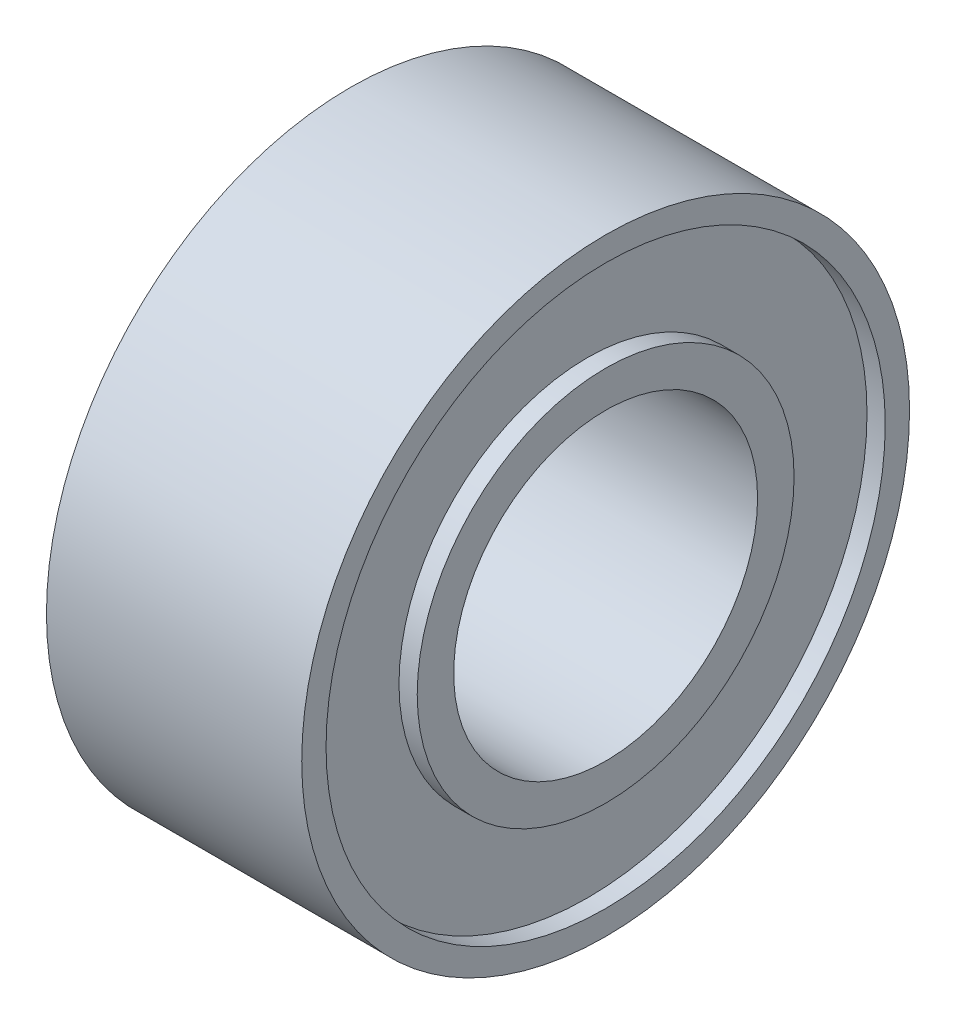
ISO-10303-21;
HEADER;
FILE_DESCRIPTION(('STEP AP214'),'2;1');
FILE_NAME('part.step','',(''),(''),'','','');
FILE_SCHEMA(('AUTOMOTIVE_DESIGN { 1 0 10303 214 1 1 1 1 }'));
ENDSEC;
DATA;
#1=APPLICATION_CONTEXT('core data for automotive mechanical design processes');
#2=APPLICATION_PROTOCOL_DEFINITION('international standard','automotive_design',2000,#1);
#3=PRODUCT_CONTEXT('',#1,'mechanical');
#4=PRODUCT('Part','Part','',(#3));
#5=PRODUCT_RELATED_PRODUCT_CATEGORY('part','',(#4));
#6=PRODUCT_DEFINITION_FORMATION('','',#4);
#7=PRODUCT_DEFINITION_CONTEXT('part definition',#1,'design');
#8=PRODUCT_DEFINITION('design','',#6,#7);
#9=PRODUCT_DEFINITION_SHAPE('','',#8);
#10=(LENGTH_UNIT() NAMED_UNIT(*) SI_UNIT(.MILLI.,.METRE.));
#11=(NAMED_UNIT(*) PLANE_ANGLE_UNIT() SI_UNIT($,.RADIAN.));
#12=(NAMED_UNIT(*) SI_UNIT($,.STERADIAN.) SOLID_ANGLE_UNIT());
#13=UNCERTAINTY_MEASURE_WITH_UNIT(LENGTH_MEASURE(1.E-05),#10,'distance_accuracy_value','');
#14=(GEOMETRIC_REPRESENTATION_CONTEXT(3) GLOBAL_UNCERTAINTY_ASSIGNED_CONTEXT((#13)) GLOBAL_UNIT_ASSIGNED_CONTEXT((#10,
#11,#12)) REPRESENTATION_CONTEXT('',''));
#15=CARTESIAN_POINT('',(0.,0.,0.));
#16=DIRECTION('',(0.,0.,1.));
#17=DIRECTION('',(1.,0.,0.));
#18=AXIS2_PLACEMENT_3D('',#15,#16,#17);
#19=CARTESIAN_POINT('',(-2.09999999999999,2.49999999997641,-2.26485497023532E-11));
#20=DIRECTION('',(-1.,0.,0.));
#21=DIRECTION('',(0.,0.,1.00000000000006));
#22=AXIS2_PLACEMENT_3D('',#19,#20,#21);
#23=PLANE('',#22);
#24=CARTESIAN_POINT('',(-2.09999999999999,0.,0.));
#25=DIRECTION('',(1.,0.,0.));
#26=DIRECTION('',(0.,0.,-1.00000000000006));
#27=AXIS2_PLACEMENT_3D('',#24,#25,#26);
#28=CIRCLE('',#27,2.5);
#29=CARTESIAN_POINT('',(-2.09999999999999,0.,-2.50000000000014));
#30=VERTEX_POINT('',#29);
#31=EDGE_CURVE('E84',#30,#30,#28,.T.);
#32=ORIENTED_EDGE('',*,*,#31,.T.);
#33=EDGE_LOOP('',(#32));
#34=FACE_BOUND('',#33,.T.);
#35=CARTESIAN_POINT('',(-2.09999999999999,0.,0.));
#36=DIRECTION('',(1.,0.,0.));
#37=DIRECTION('',(0.,0.,-1.00000000000006));
#38=AXIS2_PLACEMENT_3D('',#35,#36,#37);
#39=CIRCLE('',#38,3.1);
#40=CARTESIAN_POINT('',(-2.09999999999999,0.,-3.10000000000017));
#41=VERTEX_POINT('',#40);
#42=EDGE_CURVE('E12',#41,#41,#39,.T.);
#43=ORIENTED_EDGE('',*,*,#42,.F.);
#44=EDGE_LOOP('',(#43));
#45=FACE_BOUND('',#44,.T.);
#46=ADVANCED_FACE('F44',(#34,#45),#23,.T.);
#47=CARTESIAN_POINT('',(0.,0.,0.));
#48=DIRECTION('',(1.,0.,0.));
#49=DIRECTION('',(0.,0.,-1.00000000000006));
#50=AXIS2_PLACEMENT_3D('',#47,#48,#49);
#51=CYLINDRICAL_SURFACE('',#50,3.1);
#52=ORIENTED_EDGE('',*,*,#42,.T.);
#53=EDGE_LOOP('',(#52));
#54=FACE_BOUND('',#53,.T.);
#55=CARTESIAN_POINT('',(-1.7999999999998,0.,0.));
#56=DIRECTION('',(1.,0.,0.));
#57=DIRECTION('',(0.,0.,-1.00000000000006));
#58=AXIS2_PLACEMENT_3D('',#55,#56,#57);
#59=CIRCLE('',#58,3.1);
#60=CARTESIAN_POINT('',(-1.7999999999998,0.,-3.10000000000017));
#61=VERTEX_POINT('',#60);
#62=EDGE_CURVE('E50',#61,#61,#59,.T.);
#63=ORIENTED_EDGE('',*,*,#62,.F.);
#64=EDGE_LOOP('',(#63));
#65=FACE_BOUND('',#64,.T.);
#66=ADVANCED_FACE('F102',(#54,#65),#51,.T.);
#67=CARTESIAN_POINT('',(-1.7999999999998,3.09999999996702,-2.05391259555654E-11));
#68=DIRECTION('',(-1.,0.,0.));
#69=DIRECTION('',(0.,0.,1.00000000000006));
#70=AXIS2_PLACEMENT_3D('',#67,#68,#69);
#71=PLANE('',#70);
#72=ORIENTED_EDGE('',*,*,#62,.T.);
#73=EDGE_LOOP('',(#72));
#74=FACE_BOUND('',#73,.T.);
#75=CARTESIAN_POINT('',(-1.7999999999998,0.,0.));
#76=DIRECTION('',(1.,0.,0.));
#77=DIRECTION('',(0.,0.,-1.00000000000006));
#78=AXIS2_PLACEMENT_3D('',#75,#76,#77);
#79=CIRCLE('',#78,4.6);
#80=CARTESIAN_POINT('',(-1.7999999999998,0.,-4.60000000000026));
#81=VERTEX_POINT('',#80);
#82=EDGE_CURVE('E54',#81,#81,#79,.T.);
#83=ORIENTED_EDGE('',*,*,#82,.F.);
#84=EDGE_LOOP('',(#83));
#85=FACE_BOUND('',#84,.T.);
#86=ADVANCED_FACE('F106',(#74,#85),#71,.T.);
#87=CARTESIAN_POINT('',(0.,0.,0.));
#88=DIRECTION('',(1.,0.,0.));
#89=DIRECTION('',(0.,0.,-1.00000000000006));
#90=AXIS2_PLACEMENT_3D('',#87,#88,#89);
#91=CYLINDRICAL_SURFACE('',#90,4.6);
#92=ORIENTED_EDGE('',*,*,#82,.T.);
#93=EDGE_LOOP('',(#92));
#94=FACE_BOUND('',#93,.T.);
#95=CARTESIAN_POINT('',(-2.09999999999999,0.,0.));
#96=DIRECTION('',(1.,0.,0.));
#97=DIRECTION('',(0.,0.,-1.00000000000006));
#98=AXIS2_PLACEMENT_3D('',#95,#96,#97);
#99=CIRCLE('',#98,4.6);
#100=CARTESIAN_POINT('',(-2.09999999999999,0.,-4.60000000000026));
#101=VERTEX_POINT('',#100);
#102=EDGE_CURVE('E58',#101,#101,#99,.T.);
#103=ORIENTED_EDGE('',*,*,#102,.F.);
#104=EDGE_LOOP('',(#103));
#105=FACE_BOUND('',#104,.T.);
#106=ADVANCED_FACE('F110',(#94,#105),#91,.F.);
#107=CARTESIAN_POINT('',(-2.09999999999999,4.59999999998395,-1.96509475358653E-11));
#108=DIRECTION('',(-1.,0.,0.));
#109=DIRECTION('',(0.,0.,1.00000000000006));
#110=AXIS2_PLACEMENT_3D('',#107,#108,#109);
#111=PLANE('',#110);
#112=ORIENTED_EDGE('',*,*,#102,.T.);
#113=EDGE_LOOP('',(#112));
#114=FACE_BOUND('',#113,.T.);
#115=CARTESIAN_POINT('',(-2.09999999999999,0.,0.));
#116=DIRECTION('',(1.,0.,0.));
#117=DIRECTION('',(0.,0.,-1.00000000000006));
#118=AXIS2_PLACEMENT_3D('',#115,#116,#117);
#119=CIRCLE('',#118,5.);
#120=CARTESIAN_POINT('',(-2.09999999999999,0.,-5.00000000000028));
#121=VERTEX_POINT('',#120);
#122=EDGE_CURVE('E63',#121,#121,#119,.T.);
#123=ORIENTED_EDGE('',*,*,#122,.F.);
#124=EDGE_LOOP('',(#123));
#125=FACE_BOUND('',#124,.T.);
#126=ADVANCED_FACE('F116',(#114,#125),#111,.T.);
#127=CARTESIAN_POINT('',(0.,0.,0.));
#128=DIRECTION('',(1.,0.,0.));
#129=DIRECTION('',(0.,0.,-1.00000000000006));
#130=AXIS2_PLACEMENT_3D('',#127,#128,#129);
#131=CYLINDRICAL_SURFACE('',#130,5.);
#132=ORIENTED_EDGE('',*,*,#122,.T.);
#133=EDGE_LOOP('',(#132));
#134=FACE_BOUND('',#133,.T.);
#135=CARTESIAN_POINT('',(2.09999999999999,0.,0.));
#136=DIRECTION('',(1.,0.,0.));
#137=DIRECTION('',(0.,0.,-1.00000000000006));
#138=AXIS2_PLACEMENT_3D('',#135,#136,#137);
#139=CIRCLE('',#138,5.);
#140=CARTESIAN_POINT('',(2.09999999999999,0.,-5.00000000000028));
#141=VERTEX_POINT('',#140);
#142=EDGE_CURVE('E66',#141,#141,#139,.T.);
#143=ORIENTED_EDGE('',*,*,#142,.F.);
#144=EDGE_LOOP('',(#143));
#145=FACE_BOUND('',#144,.T.);
#146=ADVANCED_FACE('F120',(#134,#145),#131,.T.);
#147=CARTESIAN_POINT('',(2.09999999999999,4.59999999997063,-2.40918396343659E-11));
#148=DIRECTION('',(1.,0.,0.));
#149=DIRECTION('',(0.,0.,-1.00000000000006));
#150=AXIS2_PLACEMENT_3D('',#147,#148,#149);
#151=PLANE('',#150);
#152=ORIENTED_EDGE('',*,*,#142,.T.);
#153=EDGE_LOOP('',(#152));
#154=FACE_BOUND('',#153,.T.);
#155=CARTESIAN_POINT('',(2.09999999999999,0.,0.));
#156=DIRECTION('',(1.,0.,0.));
#157=DIRECTION('',(0.,0.,-1.00000000000006));
#158=AXIS2_PLACEMENT_3D('',#155,#156,#157);
#159=CIRCLE('',#158,4.6);
#160=CARTESIAN_POINT('',(2.09999999999999,0.,-4.60000000000026));
#161=VERTEX_POINT('',#160);
#162=EDGE_CURVE('E69',#161,#161,#159,.T.);
#163=ORIENTED_EDGE('',*,*,#162,.F.);
#164=EDGE_LOOP('',(#163));
#165=FACE_BOUND('',#164,.T.);
#166=ADVANCED_FACE('F124',(#154,#165),#151,.T.);
#167=CARTESIAN_POINT('',(0.,0.,0.));
#168=DIRECTION('',(1.,0.,0.));
#169=DIRECTION('',(0.,0.,-1.00000000000006));
#170=AXIS2_PLACEMENT_3D('',#167,#168,#169);
#171=CYLINDRICAL_SURFACE('',#170,4.6);
#172=ORIENTED_EDGE('',*,*,#162,.T.);
#173=EDGE_LOOP('',(#172));
#174=FACE_BOUND('',#173,.T.);
#175=CARTESIAN_POINT('',(1.7999999999998,0.,0.));
#176=DIRECTION('',(1.,0.,0.));
#177=DIRECTION('',(0.,0.,-1.00000000000006));
#178=AXIS2_PLACEMENT_3D('',#175,#176,#177);
#179=CIRCLE('',#178,4.6);
#180=CARTESIAN_POINT('',(1.7999999999998,0.,-4.60000000000026));
#181=VERTEX_POINT('',#180);
#182=EDGE_CURVE('E72',#181,#181,#179,.T.);
#183=ORIENTED_EDGE('',*,*,#182,.F.);
#184=EDGE_LOOP('',(#183));
#185=FACE_BOUND('',#184,.T.);
#186=ADVANCED_FACE('F128',(#174,#185),#171,.F.);
#187=CARTESIAN_POINT('',(1.7999999999998,3.09999999997057,-1.87627691161651E-11));
#188=DIRECTION('',(1.,0.,0.));
#189=DIRECTION('',(0.,0.,-1.00000000000006));
#190=AXIS2_PLACEMENT_3D('',#187,#188,#189);
#191=PLANE('',#190);
#192=ORIENTED_EDGE('',*,*,#182,.T.);
#193=EDGE_LOOP('',(#192));
#194=FACE_BOUND('',#193,.T.);
#195=CARTESIAN_POINT('',(1.7999999999998,0.,0.));
#196=DIRECTION('',(1.,0.,0.));
#197=DIRECTION('',(0.,0.,-1.00000000000006));
#198=AXIS2_PLACEMENT_3D('',#195,#196,#197);
#199=CIRCLE('',#198,3.1);
#200=CARTESIAN_POINT('',(1.7999999999998,0.,-3.10000000000017));
#201=VERTEX_POINT('',#200);
#202=EDGE_CURVE('E75',#201,#201,#199,.T.);
#203=ORIENTED_EDGE('',*,*,#202,.F.);
#204=EDGE_LOOP('',(#203));
#205=FACE_BOUND('',#204,.T.);
#206=ADVANCED_FACE('F132',(#194,#205),#191,.T.);
#207=CARTESIAN_POINT('',(0.,0.,0.));
#208=DIRECTION('',(1.,0.,0.));
#209=DIRECTION('',(0.,0.,-1.00000000000006));
#210=AXIS2_PLACEMENT_3D('',#207,#208,#209);
#211=CYLINDRICAL_SURFACE('',#210,3.1);
#212=ORIENTED_EDGE('',*,*,#202,.T.);
#213=EDGE_LOOP('',(#212));
#214=FACE_BOUND('',#213,.T.);
#215=CARTESIAN_POINT('',(2.09999999999999,0.,0.));
#216=DIRECTION('',(1.,0.,0.));
#217=DIRECTION('',(0.,0.,-1.00000000000006));
#218=AXIS2_PLACEMENT_3D('',#215,#216,#217);
#219=CIRCLE('',#218,3.1);
#220=CARTESIAN_POINT('',(2.09999999999999,0.,-3.10000000000017));
#221=VERTEX_POINT('',#220);
#222=EDGE_CURVE('E78',#221,#221,#219,.T.);
#223=ORIENTED_EDGE('',*,*,#222,.F.);
#224=EDGE_LOOP('',(#223));
#225=FACE_BOUND('',#224,.T.);
#226=ADVANCED_FACE('F98',(#214,#225),#211,.T.);
#227=CARTESIAN_POINT('',(2.09999999999999,2.49999999998085,-1.95399252334028E-11));
#228=DIRECTION('',(1.,0.,0.));
#229=DIRECTION('',(0.,0.,-1.00000000000006));
#230=AXIS2_PLACEMENT_3D('',#227,#228,#229);
#231=PLANE('',#230);
#232=ORIENTED_EDGE('',*,*,#222,.T.);
#233=EDGE_LOOP('',(#232));
#234=FACE_BOUND('',#233,.T.);
#235=CARTESIAN_POINT('',(2.09999999999999,0.,0.));
#236=DIRECTION('',(1.,0.,0.));
#237=DIRECTION('',(0.,0.,-1.00000000000006));
#238=AXIS2_PLACEMENT_3D('',#235,#236,#237);
#239=CIRCLE('',#238,2.5);
#240=CARTESIAN_POINT('',(2.09999999999999,0.,-2.50000000000014));
#241=VERTEX_POINT('',#240);
#242=EDGE_CURVE('E81',#241,#241,#239,.T.);
#243=ORIENTED_EDGE('',*,*,#242,.F.);
#244=EDGE_LOOP('',(#243));
#245=FACE_BOUND('',#244,.T.);
#246=ADVANCED_FACE('F92',(#234,#245),#231,.T.);
#247=CARTESIAN_POINT('',(0.,0.,0.));
#248=DIRECTION('',(1.,0.,0.));
#249=DIRECTION('',(0.,0.,-1.00000000000006));
#250=AXIS2_PLACEMENT_3D('',#247,#248,#249);
#251=CYLINDRICAL_SURFACE('',#250,2.5);
#252=ORIENTED_EDGE('',*,*,#242,.T.);
#253=EDGE_LOOP('',(#252));
#254=FACE_BOUND('',#253,.T.);
#255=ORIENTED_EDGE('',*,*,#31,.F.);
#256=EDGE_LOOP('',(#255));
#257=FACE_BOUND('',#256,.T.);
#258=ADVANCED_FACE('F90',(#254,#257),#251,.F.);
#259=CLOSED_SHELL('',(#46,#66,#86,#106,#126,#146,#166,#186,#206,#226,#246,#258));
#260=MANIFOLD_SOLID_BREP('B2',#259);
#261=ADVANCED_BREP_SHAPE_REPRESENTATION('',(#18,#260),#14);
#262=SHAPE_DEFINITION_REPRESENTATION(#9,#261);
ENDSEC;
END-ISO-10303-21;
